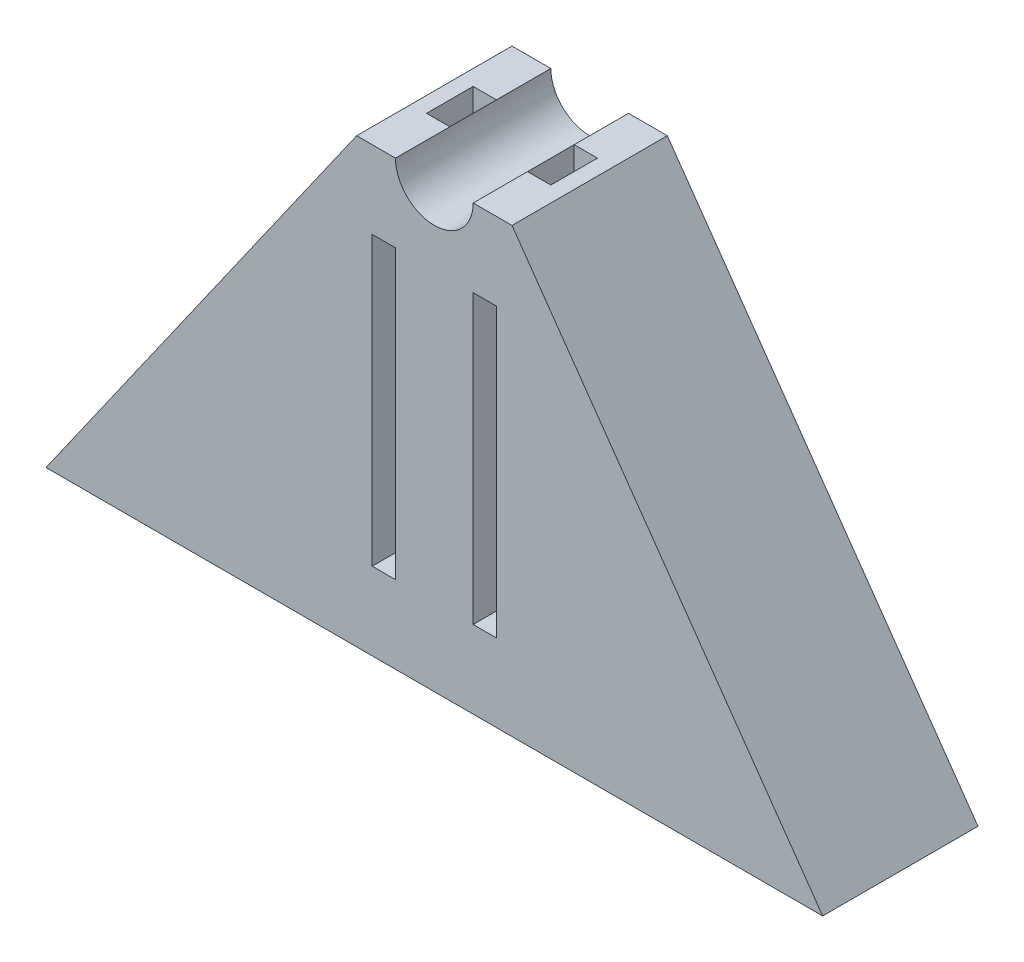
ISO-10303-21;
HEADER;
FILE_DESCRIPTION(('STEP AP214'),'2;1');
FILE_NAME('part.step','',(''),(''),'','','');
FILE_SCHEMA(('AUTOMOTIVE_DESIGN { 1 0 10303 214 1 1 1 1 }'));
ENDSEC;
DATA;
#1=APPLICATION_CONTEXT('core data for automotive mechanical design processes');
#2=APPLICATION_PROTOCOL_DEFINITION('international standard','automotive_design',2000,#1);
#3=PRODUCT_CONTEXT('',#1,'mechanical');
#4=PRODUCT('Part','Part','',(#3));
#5=PRODUCT_RELATED_PRODUCT_CATEGORY('part','',(#4));
#6=PRODUCT_DEFINITION_FORMATION('','',#4);
#7=PRODUCT_DEFINITION_CONTEXT('part definition',#1,'design');
#8=PRODUCT_DEFINITION('design','',#6,#7);
#9=PRODUCT_DEFINITION_SHAPE('','',#8);
#10=(LENGTH_UNIT() NAMED_UNIT(*) SI_UNIT(.MILLI.,.METRE.));
#11=(NAMED_UNIT(*) PLANE_ANGLE_UNIT() SI_UNIT($,.RADIAN.));
#12=(NAMED_UNIT(*) SI_UNIT($,.STERADIAN.) SOLID_ANGLE_UNIT());
#13=UNCERTAINTY_MEASURE_WITH_UNIT(LENGTH_MEASURE(1.E-05),#10,'distance_accuracy_value','');
#14=(GEOMETRIC_REPRESENTATION_CONTEXT(3) GLOBAL_UNCERTAINTY_ASSIGNED_CONTEXT((#13)) GLOBAL_UNIT_ASSIGNED_CONTEXT((#10,
#11,#12)) REPRESENTATION_CONTEXT('',''));
#15=CARTESIAN_POINT('',(0.,0.,0.));
#16=DIRECTION('',(0.,0.,1.));
#17=DIRECTION('',(1.,0.,0.));
#18=AXIS2_PLACEMENT_3D('',#15,#16,#17);
#19=CARTESIAN_POINT('',(-4.,0.,6.5));
#20=DIRECTION('',(0.,0.,1.));
#21=DIRECTION('',(1.,0.,0.));
#22=AXIS2_PLACEMENT_3D('',#19,#20,#21);
#23=PLANE('',#22);
#24=DIRECTION('',(1.,0.,0.));
#25=VECTOR('',#24,1.);
#26=CARTESIAN_POINT('',(-4.,-5.,6.5));
#27=LINE('',#26,#25);
#28=CARTESIAN_POINT('',(-4.,-5.,6.5));
#29=VERTEX_POINT('',#28);
#30=CARTESIAN_POINT('',(-2.5,-5.,6.5));
#31=VERTEX_POINT('',#30);
#32=EDGE_CURVE('E354',#29,#31,#27,.T.);
#33=ORIENTED_EDGE('',*,*,#32,.F.);
#34=DIRECTION('',(0.,-1.,0.));
#35=VECTOR('',#34,1.);
#36=CARTESIAN_POINT('',(-4.,0.,6.5));
#37=LINE('',#36,#35);
#38=CARTESIAN_POINT('',(-4.,0.,6.5));
#39=VERTEX_POINT('',#38);
#40=EDGE_CURVE('E437',#39,#29,#37,.T.);
#41=ORIENTED_EDGE('',*,*,#40,.F.);
#42=DIRECTION('',(-1.,0.,0.));
#43=VECTOR('',#42,1.);
#44=CARTESIAN_POINT('',(-4.,0.,6.5));
#45=LINE('',#44,#43);
#46=CARTESIAN_POINT('',(-2.5,0.,6.5));
#47=VERTEX_POINT('',#46);
#48=EDGE_CURVE('E420',#47,#39,#45,.T.);
#49=ORIENTED_EDGE('',*,*,#48,.F.);
#50=DIRECTION('',(0.,-1.,0.));
#51=VECTOR('',#50,1.);
#52=CARTESIAN_POINT('',(-2.5,0.,6.5));
#53=LINE('',#52,#51);
#54=EDGE_CURVE('E443',#47,#31,#53,.T.);
#55=ORIENTED_EDGE('',*,*,#54,.T.);
#56=EDGE_LOOP('',(#33,#41,#49,#55));
#57=FACE_BOUND('',#56,.T.);
#58=ADVANCED_FACE('F38',(#57),#23,.F.);
#59=CARTESIAN_POINT('',(-4.,0.,3.5));
#60=DIRECTION('',(0.,0.,-1.));
#61=DIRECTION('',(-1.,0.,0.));
#62=AXIS2_PLACEMENT_3D('',#59,#60,#61);
#63=PLANE('',#62);
#64=DIRECTION('',(-1.,0.,0.));
#65=VECTOR('',#64,1.);
#66=CARTESIAN_POINT('',(-4.,-5.,3.5));
#67=LINE('',#66,#65);
#68=CARTESIAN_POINT('',(-2.5,-5.,3.5));
#69=VERTEX_POINT('',#68);
#70=CARTESIAN_POINT('',(-4.,-5.,3.5));
#71=VERTEX_POINT('',#70);
#72=EDGE_CURVE('E11',#69,#71,#67,.T.);
#73=ORIENTED_EDGE('',*,*,#72,.F.);
#74=DIRECTION('',(0.,-1.,0.));
#75=VECTOR('',#74,1.);
#76=CARTESIAN_POINT('',(-2.5,0.,3.5));
#77=LINE('',#76,#75);
#78=CARTESIAN_POINT('',(-2.5,0.,3.5));
#79=VERTEX_POINT('',#78);
#80=EDGE_CURVE('E448',#79,#69,#77,.T.);
#81=ORIENTED_EDGE('',*,*,#80,.F.);
#82=DIRECTION('',(1.,0.,0.));
#83=VECTOR('',#82,1.);
#84=CARTESIAN_POINT('',(-4.,0.,3.5));
#85=LINE('',#84,#83);
#86=CARTESIAN_POINT('',(-4.,0.,3.5));
#87=VERTEX_POINT('',#86);
#88=EDGE_CURVE('E411',#87,#79,#85,.T.);
#89=ORIENTED_EDGE('',*,*,#88,.F.);
#90=DIRECTION('',(0.,-1.,0.));
#91=VECTOR('',#90,1.);
#92=CARTESIAN_POINT('',(-4.,0.,3.5));
#93=LINE('',#92,#91);
#94=EDGE_CURVE('E453',#87,#71,#93,.T.);
#95=ORIENTED_EDGE('',*,*,#94,.T.);
#96=EDGE_LOOP('',(#73,#81,#89,#95));
#97=FACE_BOUND('',#96,.T.);
#98=ADVANCED_FACE('F541',(#97),#63,.F.);
#99=CARTESIAN_POINT('',(4.,0.,3.5));
#100=DIRECTION('',(0.,0.,1.));
#101=DIRECTION('',(1.,0.,0.));
#102=AXIS2_PLACEMENT_3D('',#99,#100,#101);
#103=PLANE('',#102);
#104=DIRECTION('',(0.,-1.,0.));
#105=VECTOR('',#104,1.);
#106=CARTESIAN_POINT('',(2.5,0.,3.5));
#107=LINE('',#106,#105);
#108=CARTESIAN_POINT('',(2.5,0.,3.5));
#109=VERTEX_POINT('',#108);
#110=CARTESIAN_POINT('',(2.5,-5.,3.5));
#111=VERTEX_POINT('',#110);
#112=EDGE_CURVE('E393',#109,#111,#107,.T.);
#113=ORIENTED_EDGE('',*,*,#112,.T.);
#114=DIRECTION('',(1.,0.,0.));
#115=VECTOR('',#114,1.);
#116=CARTESIAN_POINT('',(4.,-5.,3.5));
#117=LINE('',#116,#115);
#118=CARTESIAN_POINT('',(4.,-5.,3.5));
#119=VERTEX_POINT('',#118);
#120=EDGE_CURVE('E346',#111,#119,#117,.T.);
#121=ORIENTED_EDGE('',*,*,#120,.T.);
#122=DIRECTION('',(0.,-1.,0.));
#123=VECTOR('',#122,1.);
#124=CARTESIAN_POINT('',(4.,0.,3.5));
#125=LINE('',#124,#123);
#126=CARTESIAN_POINT('',(4.,0.,3.5));
#127=VERTEX_POINT('',#126);
#128=EDGE_CURVE('E387',#127,#119,#125,.T.);
#129=ORIENTED_EDGE('',*,*,#128,.F.);
#130=DIRECTION('',(-1.,0.,0.));
#131=VECTOR('',#130,1.);
#132=CARTESIAN_POINT('',(4.,0.,3.5));
#133=LINE('',#132,#131);
#134=EDGE_CURVE('E368',#127,#109,#133,.T.);
#135=ORIENTED_EDGE('',*,*,#134,.T.);
#136=EDGE_LOOP('',(#113,#121,#129,#135));
#137=FACE_BOUND('',#136,.T.);
#138=ADVANCED_FACE('F629',(#137),#103,.T.);
#139=CARTESIAN_POINT('',(4.,0.,6.5));
#140=DIRECTION('',(0.,0.,-1.));
#141=DIRECTION('',(-1.,0.,0.));
#142=AXIS2_PLACEMENT_3D('',#139,#140,#141);
#143=PLANE('',#142);
#144=DIRECTION('',(0.,-1.,0.));
#145=VECTOR('',#144,1.);
#146=CARTESIAN_POINT('',(4.,0.,6.5));
#147=LINE('',#146,#145);
#148=CARTESIAN_POINT('',(4.,0.,6.5));
#149=VERTEX_POINT('',#148);
#150=CARTESIAN_POINT('',(4.,-5.,6.5));
#151=VERTEX_POINT('',#150);
#152=EDGE_CURVE('E403',#149,#151,#147,.T.);
#153=ORIENTED_EDGE('',*,*,#152,.T.);
#154=DIRECTION('',(-1.,0.,0.));
#155=VECTOR('',#154,1.);
#156=CARTESIAN_POINT('',(4.,-5.,6.5));
#157=LINE('',#156,#155);
#158=CARTESIAN_POINT('',(2.5,-5.,6.5));
#159=VERTEX_POINT('',#158);
#160=EDGE_CURVE('E525',#151,#159,#157,.T.);
#161=ORIENTED_EDGE('',*,*,#160,.T.);
#162=DIRECTION('',(0.,-1.,0.));
#163=VECTOR('',#162,1.);
#164=CARTESIAN_POINT('',(2.5,0.,6.5));
#165=LINE('',#164,#163);
#166=CARTESIAN_POINT('',(2.5,0.,6.5));
#167=VERTEX_POINT('',#166);
#168=EDGE_CURVE('E398',#167,#159,#165,.T.);
#169=ORIENTED_EDGE('',*,*,#168,.F.);
#170=DIRECTION('',(1.,0.,0.));
#171=VECTOR('',#170,1.);
#172=CARTESIAN_POINT('',(4.,0.,6.5));
#173=LINE('',#172,#171);
#174=EDGE_CURVE('E361',#167,#149,#173,.T.);
#175=ORIENTED_EDGE('',*,*,#174,.T.);
#176=EDGE_LOOP('',(#153,#161,#169,#175));
#177=FACE_BOUND('',#176,.T.);
#178=ADVANCED_FACE('F606',(#177),#143,.T.);
#179=CARTESIAN_POINT('',(-25.,-28.5,10.));
#180=DIRECTION('',(0.,1.,0.));
#181=DIRECTION('',(0.,0.,1.));
#182=AXIS2_PLACEMENT_3D('',#179,#180,#181);
#183=PLANE('',#182);
#184=DIRECTION('',(1.,0.,0.));
#185=VECTOR('',#184,1.);
#186=CARTESIAN_POINT('',(-25.,-28.5,0.));
#187=LINE('',#186,#185);
#188=CARTESIAN_POINT('',(-25.,-28.5,0.));
#189=VERTEX_POINT('',#188);
#190=CARTESIAN_POINT('',(25.,-28.5,0.));
#191=VERTEX_POINT('',#190);
#192=EDGE_CURVE('E481',#189,#191,#187,.T.);
#193=ORIENTED_EDGE('',*,*,#192,.T.);
#194=DIRECTION('',(0.,0.,-1.));
#195=VECTOR('',#194,1.);
#196=CARTESIAN_POINT('',(25.,-28.5,10.));
#197=LINE('',#196,#195);
#198=CARTESIAN_POINT('',(25.,-28.5,10.));
#199=VERTEX_POINT('',#198);
#200=EDGE_CURVE('E514',#199,#191,#197,.T.);
#201=ORIENTED_EDGE('',*,*,#200,.F.);
#202=DIRECTION('',(1.,0.,0.));
#203=VECTOR('',#202,1.);
#204=CARTESIAN_POINT('',(-25.,-28.5,10.));
#205=LINE('',#204,#203);
#206=CARTESIAN_POINT('',(-25.,-28.5,10.));
#207=VERTEX_POINT('',#206);
#208=EDGE_CURVE('E461',#207,#199,#205,.T.);
#209=ORIENTED_EDGE('',*,*,#208,.F.);
#210=DIRECTION('',(0.,0.,-1.));
#211=VECTOR('',#210,1.);
#212=CARTESIAN_POINT('',(-25.,-28.5,10.));
#213=LINE('',#212,#211);
#214=EDGE_CURVE('E518',#207,#189,#213,.T.);
#215=ORIENTED_EDGE('',*,*,#214,.T.);
#216=EDGE_LOOP('',(#193,#201,#209,#215));
#217=FACE_BOUND('',#216,.T.);
#218=DIRECTION('',(1.,0.,0.));
#219=VECTOR('',#218,1.);
#220=CARTESIAN_POINT('',(-4.,-28.5,3.5));
#221=LINE('',#220,#219);
#222=CARTESIAN_POINT('',(-4.,-28.5,3.5));
#223=VERTEX_POINT('',#222);
#224=CARTESIAN_POINT('',(-2.5,-28.5,3.5));
#225=VERTEX_POINT('',#224);
#226=EDGE_CURVE('E426',#223,#225,#221,.T.);
#227=ORIENTED_EDGE('',*,*,#226,.F.);
#228=DIRECTION('',(0.,0.,-1.));
#229=VECTOR('',#228,1.);
#230=CARTESIAN_POINT('',(-4.,-28.5,6.5));
#231=LINE('',#230,#229);
#232=CARTESIAN_POINT('',(-4.,-28.5,6.5));
#233=VERTEX_POINT('',#232);
#234=EDGE_CURVE('E391',#233,#223,#231,.T.);
#235=ORIENTED_EDGE('',*,*,#234,.F.);
#236=DIRECTION('',(-1.,0.,0.));
#237=VECTOR('',#236,1.);
#238=CARTESIAN_POINT('',(-4.,-28.5,6.5));
#239=LINE('',#238,#237);
#240=CARTESIAN_POINT('',(-2.5,-28.5,6.5));
#241=VERTEX_POINT('',#240);
#242=EDGE_CURVE('E412',#241,#233,#239,.T.);
#243=ORIENTED_EDGE('',*,*,#242,.F.);
#244=DIRECTION('',(0.,0.,1.));
#245=VECTOR('',#244,1.);
#246=CARTESIAN_POINT('',(-2.5,-28.5,6.5));
#247=LINE('',#246,#245);
#248=EDGE_CURVE('E430',#225,#241,#247,.T.);
#249=ORIENTED_EDGE('',*,*,#248,.F.);
#250=EDGE_LOOP('',(#227,#235,#243,#249));
#251=FACE_BOUND('',#250,.T.);
#252=DIRECTION('',(0.,0.,-1.));
#253=VECTOR('',#252,1.);
#254=CARTESIAN_POINT('',(4.,-28.5,6.5));
#255=LINE('',#254,#253);
#256=CARTESIAN_POINT('',(4.,-28.5,6.5));
#257=VERTEX_POINT('',#256);
#258=CARTESIAN_POINT('',(4.,-28.5,3.5));
#259=VERTEX_POINT('',#258);
#260=EDGE_CURVE('E357',#257,#259,#255,.T.);
#261=ORIENTED_EDGE('',*,*,#260,.T.);
#262=DIRECTION('',(-1.,0.,0.));
#263=VECTOR('',#262,1.);
#264=CARTESIAN_POINT('',(4.,-28.5,3.5));
#265=LINE('',#264,#263);
#266=CARTESIAN_POINT('',(2.5,-28.5,3.5));
#267=VERTEX_POINT('',#266);
#268=EDGE_CURVE('E362',#259,#267,#265,.T.);
#269=ORIENTED_EDGE('',*,*,#268,.T.);
#270=DIRECTION('',(0.,0.,1.));
#271=VECTOR('',#270,1.);
#272=CARTESIAN_POINT('',(2.5,-28.5,6.5));
#273=LINE('',#272,#271);
#274=CARTESIAN_POINT('',(2.5,-28.5,6.5));
#275=VERTEX_POINT('',#274);
#276=EDGE_CURVE('E380',#267,#275,#273,.T.);
#277=ORIENTED_EDGE('',*,*,#276,.T.);
#278=DIRECTION('',(1.,0.,0.));
#279=VECTOR('',#278,1.);
#280=CARTESIAN_POINT('',(4.,-28.5,6.5));
#281=LINE('',#280,#279);
#282=EDGE_CURVE('E376',#275,#257,#281,.T.);
#283=ORIENTED_EDGE('',*,*,#282,.T.);
#284=EDGE_LOOP('',(#261,#269,#277,#283));
#285=FACE_BOUND('',#284,.T.);
#286=ADVANCED_FACE('F645',(#217,#251,#285),#183,.F.);
#287=CARTESIAN_POINT('',(5.,0.,10.));
#288=DIRECTION('',(0.,-1.,0.));
#289=DIRECTION('',(1.,0.,0.));
#290=AXIS2_PLACEMENT_3D('',#287,#288,#289);
#291=PLANE('',#290);
#292=ORIENTED_EDGE('',*,*,#134,.F.);
#293=DIRECTION('',(0.,0.,-1.));
#294=VECTOR('',#293,1.);
#295=CARTESIAN_POINT('',(4.,0.,6.5));
#296=LINE('',#295,#294);
#297=EDGE_CURVE('E358',#149,#127,#296,.T.);
#298=ORIENTED_EDGE('',*,*,#297,.F.);
#299=ORIENTED_EDGE('',*,*,#174,.F.);
#300=DIRECTION('',(0.,0.,-1.));
#301=VECTOR('',#300,1.);
#302=CARTESIAN_POINT('',(2.5,0.,10.));
#303=LINE('',#302,#301);
#304=CARTESIAN_POINT('',(2.5,0.,10.));
#305=VERTEX_POINT('',#304);
#306=EDGE_CURVE('E506',#305,#167,#303,.T.);
#307=ORIENTED_EDGE('',*,*,#306,.F.);
#308=DIRECTION('',(-1.,0.,0.));
#309=VECTOR('',#308,1.);
#310=CARTESIAN_POINT('',(5.,0.,10.));
#311=LINE('',#310,#309);
#312=CARTESIAN_POINT('',(5.,0.,10.));
#313=VERTEX_POINT('',#312);
#314=EDGE_CURVE('E468',#313,#305,#311,.T.);
#315=ORIENTED_EDGE('',*,*,#314,.F.);
#316=DIRECTION('',(0.,0.,-1.));
#317=VECTOR('',#316,1.);
#318=CARTESIAN_POINT('',(5.,0.,10.));
#319=LINE('',#318,#317);
#320=CARTESIAN_POINT('',(5.,0.,0.));
#321=VERTEX_POINT('',#320);
#322=EDGE_CURVE('E510',#313,#321,#319,.T.);
#323=ORIENTED_EDGE('',*,*,#322,.T.);
#324=DIRECTION('',(-1.,0.,0.));
#325=VECTOR('',#324,1.);
#326=CARTESIAN_POINT('',(5.,0.,0.));
#327=LINE('',#326,#325);
#328=CARTESIAN_POINT('',(2.5,0.,0.));
#329=VERTEX_POINT('',#328);
#330=EDGE_CURVE('E487',#321,#329,#327,.T.);
#331=ORIENTED_EDGE('',*,*,#330,.T.);
#332=EDGE_CURVE('E505',#109,#329,#303,.T.);
#333=ORIENTED_EDGE('',*,*,#332,.F.);
#334=EDGE_LOOP('',(#292,#298,#299,#307,#315,#323,#331,#333));
#335=FACE_BOUND('',#334,.T.);
#336=ADVANCED_FACE('F588',(#335),#291,.F.);
#337=CARTESIAN_POINT('',(-5.,0.,10.));
#338=DIRECTION('',(0.818556692462413,-0.57442574909643,0.));
#339=DIRECTION('',(0.57442574909643,0.818556692462413,0.));
#340=AXIS2_PLACEMENT_3D('',#337,#338,#339);
#341=PLANE('',#340);
#342=DIRECTION('',(-0.57442574909643,-0.818556692462413,0.));
#343=VECTOR('',#342,1.);
#344=CARTESIAN_POINT('',(-5.,0.,0.));
#345=LINE('',#344,#343);
#346=CARTESIAN_POINT('',(-5.,0.,0.));
#347=VERTEX_POINT('',#346);
#348=EDGE_CURVE('E441',#347,#189,#345,.T.);
#349=ORIENTED_EDGE('',*,*,#348,.T.);
#350=ORIENTED_EDGE('',*,*,#214,.F.);
#351=DIRECTION('',(-0.57442574909643,-0.818556692462413,0.));
#352=VECTOR('',#351,1.);
#353=CARTESIAN_POINT('',(-5.,0.,10.));
#354=LINE('',#353,#352);
#355=CARTESIAN_POINT('',(-5.,0.,10.));
#356=VERTEX_POINT('',#355);
#357=EDGE_CURVE('E457',#356,#207,#354,.T.);
#358=ORIENTED_EDGE('',*,*,#357,.F.);
#359=DIRECTION('',(0.,0.,-1.));
#360=VECTOR('',#359,1.);
#361=CARTESIAN_POINT('',(-5.,0.,10.));
#362=LINE('',#361,#360);
#363=EDGE_CURVE('E477',#356,#347,#362,.T.);
#364=ORIENTED_EDGE('',*,*,#363,.T.);
#365=EDGE_LOOP('',(#349,#350,#358,#364));
#366=FACE_BOUND('',#365,.T.);
#367=ADVANCED_FACE('F40',(#366),#341,.F.);
#368=CARTESIAN_POINT('',(25.,-28.5,10.));
#369=DIRECTION('',(-0.818556692462413,-0.57442574909643,0.));
#370=DIRECTION('',(0.57442574909643,-0.818556692462413,0.));
#371=AXIS2_PLACEMENT_3D('',#368,#369,#370);
#372=PLANE('',#371);
#373=DIRECTION('',(-0.57442574909643,0.818556692462413,0.));
#374=VECTOR('',#373,1.);
#375=CARTESIAN_POINT('',(25.,-28.5,0.));
#376=LINE('',#375,#374);
#377=EDGE_CURVE('E484',#191,#321,#376,.T.);
#378=ORIENTED_EDGE('',*,*,#377,.T.);
#379=ORIENTED_EDGE('',*,*,#322,.F.);
#380=DIRECTION('',(-0.57442574909643,0.818556692462413,0.));
#381=VECTOR('',#380,1.);
#382=CARTESIAN_POINT('',(25.,-28.5,10.));
#383=LINE('',#382,#381);
#384=EDGE_CURVE('E465',#199,#313,#383,.T.);
#385=ORIENTED_EDGE('',*,*,#384,.F.);
#386=ORIENTED_EDGE('',*,*,#200,.T.);
#387=EDGE_LOOP('',(#378,#379,#385,#386));
#388=FACE_BOUND('',#387,.T.);
#389=ADVANCED_FACE('F691',(#388),#372,.F.);
#390=CARTESIAN_POINT('',(0.,0.,10.));
#391=DIRECTION('',(0.,0.,-1.));
#392=DIRECTION('',(-1.,0.,0.));
#393=AXIS2_PLACEMENT_3D('',#390,#391,#392);
#394=CYLINDRICAL_SURFACE('',#393,2.5);
#395=CARTESIAN_POINT('',(0.,0.,0.));
#396=DIRECTION('',(0.,0.,-1.));
#397=DIRECTION('',(1.,0.,0.));
#398=AXIS2_PLACEMENT_3D('',#395,#396,#397);
#399=CIRCLE('',#398,2.5);
#400=CARTESIAN_POINT('',(-2.5,0.,0.));
#401=VERTEX_POINT('',#400);
#402=EDGE_CURVE('E491',#329,#401,#399,.T.);
#403=ORIENTED_EDGE('',*,*,#402,.T.);
#404=DIRECTION('',(0.,0.,-1.));
#405=VECTOR('',#404,1.);
#406=CARTESIAN_POINT('',(-2.5,0.,10.));
#407=LINE('',#406,#405);
#408=EDGE_CURVE('E500',#79,#401,#407,.T.);
#409=ORIENTED_EDGE('',*,*,#408,.F.);
#410=DIRECTION('',(0.,0.,1.));
#411=VECTOR('',#410,1.);
#412=CARTESIAN_POINT('',(-2.5,0.,6.5));
#413=LINE('',#412,#411);
#414=EDGE_CURVE('E416',#79,#47,#413,.T.);
#415=ORIENTED_EDGE('',*,*,#414,.T.);
#416=CARTESIAN_POINT('',(-2.5,0.,10.));
#417=VERTEX_POINT('',#416);
#418=EDGE_CURVE('E501',#417,#47,#407,.T.);
#419=ORIENTED_EDGE('',*,*,#418,.F.);
#420=CARTESIAN_POINT('',(0.,0.,10.));
#421=DIRECTION('',(0.,0.,-1.));
#422=DIRECTION('',(1.,0.,0.));
#423=AXIS2_PLACEMENT_3D('',#420,#421,#422);
#424=CIRCLE('',#423,2.5);
#425=EDGE_CURVE('E471',#305,#417,#424,.T.);
#426=ORIENTED_EDGE('',*,*,#425,.F.);
#427=ORIENTED_EDGE('',*,*,#306,.T.);
#428=DIRECTION('',(0.,0.,1.));
#429=VECTOR('',#428,1.);
#430=CARTESIAN_POINT('',(2.5,0.,6.5));
#431=LINE('',#430,#429);
#432=EDGE_CURVE('E365',#109,#167,#431,.T.);
#433=ORIENTED_EDGE('',*,*,#432,.F.);
#434=ORIENTED_EDGE('',*,*,#332,.T.);
#435=EDGE_LOOP('',(#403,#409,#415,#419,#426,#427,#433,#434));
#436=FACE_BOUND('',#435,.T.);
#437=ADVANCED_FACE('F553',(#436),#394,.F.);
#438=CARTESIAN_POINT('',(-2.5,0.,10.));
#439=DIRECTION('',(0.,-1.,0.));
#440=DIRECTION('',(1.,0.,0.));
#441=AXIS2_PLACEMENT_3D('',#438,#439,#440);
#442=PLANE('',#441);
#443=ORIENTED_EDGE('',*,*,#418,.T.);
#444=ORIENTED_EDGE('',*,*,#48,.T.);
#445=DIRECTION('',(0.,0.,-1.));
#446=VECTOR('',#445,1.);
#447=CARTESIAN_POINT('',(-4.,0.,6.5));
#448=LINE('',#447,#446);
#449=EDGE_CURVE('E407',#39,#87,#448,.T.);
#450=ORIENTED_EDGE('',*,*,#449,.T.);
#451=ORIENTED_EDGE('',*,*,#88,.T.);
#452=ORIENTED_EDGE('',*,*,#408,.T.);
#453=DIRECTION('',(-1.,0.,0.));
#454=VECTOR('',#453,1.);
#455=CARTESIAN_POINT('',(-2.5,0.,0.));
#456=LINE('',#455,#454);
#457=EDGE_CURVE('E462',#401,#347,#456,.T.);
#458=ORIENTED_EDGE('',*,*,#457,.T.);
#459=ORIENTED_EDGE('',*,*,#363,.F.);
#460=DIRECTION('',(-1.,0.,0.));
#461=VECTOR('',#460,1.);
#462=CARTESIAN_POINT('',(-2.5,0.,10.));
#463=LINE('',#462,#461);
#464=EDGE_CURVE('E474',#417,#356,#463,.T.);
#465=ORIENTED_EDGE('',*,*,#464,.F.);
#466=EDGE_LOOP('',(#443,#444,#450,#451,#452,#458,#459,#465));
#467=FACE_BOUND('',#466,.T.);
#468=ADVANCED_FACE('F546',(#467),#442,.F.);
#469=CARTESIAN_POINT('',(0.,0.,10.));
#470=DIRECTION('',(0.,0.,1.));
#471=DIRECTION('',(1.,0.,0.));
#472=AXIS2_PLACEMENT_3D('',#469,#470,#471);
#473=PLANE('',#472);
#474=DIRECTION('',(0.,-1.,0.));
#475=VECTOR('',#474,1.);
#476=CARTESIAN_POINT('',(-4.,0.,10.));
#477=LINE('',#476,#475);
#478=CARTESIAN_POINT('',(-4.,-5.,10.));
#479=VERTEX_POINT('',#478);
#480=CARTESIAN_POINT('',(-4.,-23.5,10.));
#481=VERTEX_POINT('',#480);
#482=EDGE_CURVE('E54',#479,#481,#477,.T.);
#483=ORIENTED_EDGE('',*,*,#482,.F.);
#484=DIRECTION('',(1.,0.,0.));
#485=VECTOR('',#484,1.);
#486=CARTESIAN_POINT('',(0.,-5.,10.));
#487=LINE('',#486,#485);
#488=CARTESIAN_POINT('',(-2.5,-5.,10.));
#489=VERTEX_POINT('',#488);
#490=EDGE_CURVE('E266',#479,#489,#487,.T.);
#491=ORIENTED_EDGE('',*,*,#490,.T.);
#492=DIRECTION('',(0.,1.,0.));
#493=VECTOR('',#492,1.);
#494=CARTESIAN_POINT('',(-2.5,0.,10.));
#495=LINE('',#494,#493);
#496=CARTESIAN_POINT('',(-2.5,-23.5,10.));
#497=VERTEX_POINT('',#496);
#498=EDGE_CURVE('E270',#497,#489,#495,.T.);
#499=ORIENTED_EDGE('',*,*,#498,.F.);
#500=DIRECTION('',(1.,0.,0.));
#501=VECTOR('',#500,1.);
#502=CARTESIAN_POINT('',(0.,-23.5,10.));
#503=LINE('',#502,#501);
#504=EDGE_CURVE('E279',#481,#497,#503,.T.);
#505=ORIENTED_EDGE('',*,*,#504,.F.);
#506=EDGE_LOOP('',(#483,#491,#499,#505));
#507=FACE_BOUND('',#506,.T.);
#508=DIRECTION('',(0.,-1.,0.));
#509=VECTOR('',#508,1.);
#510=CARTESIAN_POINT('',(2.5,0.,10.));
#511=LINE('',#510,#509);
#512=CARTESIAN_POINT('',(2.5,-5.,10.));
#513=VERTEX_POINT('',#512);
#514=CARTESIAN_POINT('',(2.5,-23.5,10.));
#515=VERTEX_POINT('',#514);
#516=EDGE_CURVE('E62',#513,#515,#511,.T.);
#517=ORIENTED_EDGE('',*,*,#516,.F.);
#518=DIRECTION('',(1.,0.,0.));
#519=VECTOR('',#518,1.);
#520=CARTESIAN_POINT('',(0.,-5.,10.));
#521=LINE('',#520,#519);
#522=CARTESIAN_POINT('',(4.,-5.,10.));
#523=VERTEX_POINT('',#522);
#524=EDGE_CURVE('E303',#513,#523,#521,.T.);
#525=ORIENTED_EDGE('',*,*,#524,.T.);
#526=DIRECTION('',(0.,1.,0.));
#527=VECTOR('',#526,1.);
#528=CARTESIAN_POINT('',(4.,0.,10.));
#529=LINE('',#528,#527);
#530=CARTESIAN_POINT('',(4.,-23.5,10.));
#531=VERTEX_POINT('',#530);
#532=EDGE_CURVE('E321',#531,#523,#529,.T.);
#533=ORIENTED_EDGE('',*,*,#532,.F.);
#534=DIRECTION('',(1.,0.,0.));
#535=VECTOR('',#534,1.);
#536=CARTESIAN_POINT('',(0.,-23.5,10.));
#537=LINE('',#536,#535);
#538=EDGE_CURVE('E317',#515,#531,#537,.T.);
#539=ORIENTED_EDGE('',*,*,#538,.F.);
#540=EDGE_LOOP('',(#517,#525,#533,#539));
#541=FACE_BOUND('',#540,.T.);
#542=ORIENTED_EDGE('',*,*,#357,.T.);
#543=ORIENTED_EDGE('',*,*,#208,.T.);
#544=ORIENTED_EDGE('',*,*,#384,.T.);
#545=ORIENTED_EDGE('',*,*,#314,.T.);
#546=ORIENTED_EDGE('',*,*,#425,.T.);
#547=ORIENTED_EDGE('',*,*,#464,.T.);
#548=EDGE_LOOP('',(#542,#543,#544,#545,#546,#547));
#549=FACE_BOUND('',#548,.T.);
#550=ADVANCED_FACE('F568',(#507,#541,#549),#473,.T.);
#551=CARTESIAN_POINT('',(0.,0.,0.));
#552=DIRECTION('',(0.,0.,1.));
#553=DIRECTION('',(1.,0.,0.));
#554=AXIS2_PLACEMENT_3D('',#551,#552,#553);
#555=PLANE('',#554);
#556=DIRECTION('',(1.,0.,0.));
#557=VECTOR('',#556,1.);
#558=CARTESIAN_POINT('',(0.,-5.,0.));
#559=LINE('',#558,#557);
#560=CARTESIAN_POINT('',(-4.,-5.,0.));
#561=VERTEX_POINT('',#560);
#562=CARTESIAN_POINT('',(-2.5,-5.,0.));
#563=VERTEX_POINT('',#562);
#564=EDGE_CURVE('E264',#561,#563,#559,.T.);
#565=ORIENTED_EDGE('',*,*,#564,.F.);
#566=DIRECTION('',(0.,-1.,0.));
#567=VECTOR('',#566,1.);
#568=CARTESIAN_POINT('',(-4.,0.,0.));
#569=LINE('',#568,#567);
#570=CARTESIAN_POINT('',(-4.,-23.5,0.));
#571=VERTEX_POINT('',#570);
#572=EDGE_CURVE('E241',#561,#571,#569,.T.);
#573=ORIENTED_EDGE('',*,*,#572,.T.);
#574=DIRECTION('',(1.,0.,0.));
#575=VECTOR('',#574,1.);
#576=CARTESIAN_POINT('',(0.,-23.5,0.));
#577=LINE('',#576,#575);
#578=CARTESIAN_POINT('',(-2.5,-23.5,0.));
#579=VERTEX_POINT('',#578);
#580=EDGE_CURVE('E253',#571,#579,#577,.T.);
#581=ORIENTED_EDGE('',*,*,#580,.T.);
#582=DIRECTION('',(0.,1.,0.));
#583=VECTOR('',#582,1.);
#584=CARTESIAN_POINT('',(-2.5,0.,0.));
#585=LINE('',#584,#583);
#586=EDGE_CURVE('E260',#579,#563,#585,.T.);
#587=ORIENTED_EDGE('',*,*,#586,.T.);
#588=EDGE_LOOP('',(#565,#573,#581,#587));
#589=FACE_BOUND('',#588,.T.);
#590=DIRECTION('',(1.,0.,0.));
#591=VECTOR('',#590,1.);
#592=CARTESIAN_POINT('',(0.,-5.,0.));
#593=LINE('',#592,#591);
#594=CARTESIAN_POINT('',(2.5,-5.,0.));
#595=VERTEX_POINT('',#594);
#596=CARTESIAN_POINT('',(4.,-5.,0.));
#597=VERTEX_POINT('',#596);
#598=EDGE_CURVE('E311',#595,#597,#593,.T.);
#599=ORIENTED_EDGE('',*,*,#598,.F.);
#600=DIRECTION('',(0.,-1.,0.));
#601=VECTOR('',#600,1.);
#602=CARTESIAN_POINT('',(2.5,0.,0.));
#603=LINE('',#602,#601);
#604=CARTESIAN_POINT('',(2.5,-23.5,0.));
#605=VERTEX_POINT('',#604);
#606=EDGE_CURVE('E298',#595,#605,#603,.T.);
#607=ORIENTED_EDGE('',*,*,#606,.T.);
#608=DIRECTION('',(1.,0.,0.));
#609=VECTOR('',#608,1.);
#610=CARTESIAN_POINT('',(0.,-23.5,0.));
#611=LINE('',#610,#609);
#612=CARTESIAN_POINT('',(4.,-23.5,0.));
#613=VERTEX_POINT('',#612);
#614=EDGE_CURVE('E302',#605,#613,#611,.T.);
#615=ORIENTED_EDGE('',*,*,#614,.T.);
#616=DIRECTION('',(0.,1.,0.));
#617=VECTOR('',#616,1.);
#618=CARTESIAN_POINT('',(4.,0.,0.));
#619=LINE('',#618,#617);
#620=EDGE_CURVE('E307',#613,#597,#619,.T.);
#621=ORIENTED_EDGE('',*,*,#620,.T.);
#622=EDGE_LOOP('',(#599,#607,#615,#621));
#623=FACE_BOUND('',#622,.T.);
#624=ORIENTED_EDGE('',*,*,#348,.F.);
#625=ORIENTED_EDGE('',*,*,#457,.F.);
#626=ORIENTED_EDGE('',*,*,#402,.F.);
#627=ORIENTED_EDGE('',*,*,#330,.F.);
#628=ORIENTED_EDGE('',*,*,#377,.F.);
#629=ORIENTED_EDGE('',*,*,#192,.F.);
#630=EDGE_LOOP('',(#624,#625,#626,#627,#628,#629));
#631=FACE_BOUND('',#630,.T.);
#632=ADVANCED_FACE('F262',(#589,#623,#631),#555,.F.);
#633=CARTESIAN_POINT('',(-4.,0.,6.5));
#634=DIRECTION('',(-1.,0.,0.));
#635=DIRECTION('',(0.,0.,1.));
#636=AXIS2_PLACEMENT_3D('',#633,#634,#635);
#637=PLANE('',#636);
#638=CARTESIAN_POINT('',(-4.,-23.5,3.5));
#639=VERTEX_POINT('',#638);
#640=EDGE_CURVE('E244',#639,#223,#93,.T.);
#641=ORIENTED_EDGE('',*,*,#640,.F.);
#642=DIRECTION('',(0.,0.,1.));
#643=VECTOR('',#642,1.);
#644=CARTESIAN_POINT('',(-4.,-23.5,0.));
#645=LINE('',#644,#643);
#646=EDGE_CURVE('E236',#571,#639,#645,.T.);
#647=ORIENTED_EDGE('',*,*,#646,.F.);
#648=ORIENTED_EDGE('',*,*,#572,.F.);
#649=DIRECTION('',(0.,0.,1.));
#650=VECTOR('',#649,1.);
#651=CARTESIAN_POINT('',(-4.,-5.,0.));
#652=LINE('',#651,#650);
#653=EDGE_CURVE('E287',#561,#71,#652,.T.);
#654=ORIENTED_EDGE('',*,*,#653,.T.);
#655=ORIENTED_EDGE('',*,*,#94,.F.);
#656=ORIENTED_EDGE('',*,*,#449,.F.);
#657=ORIENTED_EDGE('',*,*,#40,.T.);
#658=EDGE_CURVE('E291',#29,#479,#652,.T.);
#659=ORIENTED_EDGE('',*,*,#658,.T.);
#660=ORIENTED_EDGE('',*,*,#482,.T.);
#661=CARTESIAN_POINT('',(-4.,-23.5,6.5));
#662=VERTEX_POINT('',#661);
#663=EDGE_CURVE('E249',#662,#481,#645,.T.);
#664=ORIENTED_EDGE('',*,*,#663,.F.);
#665=EDGE_CURVE('E442',#662,#233,#37,.T.);
#666=ORIENTED_EDGE('',*,*,#665,.T.);
#667=ORIENTED_EDGE('',*,*,#234,.T.);
#668=EDGE_LOOP('',(#641,#647,#648,#654,#655,#656,#657,#659,#660,#664,#666,#667));
#669=FACE_BOUND('',#668,.T.);
#670=ADVANCED_FACE('F238',(#669),#637,.F.);
#671=ORIENTED_EDGE('',*,*,#665,.F.);
#672=DIRECTION('',(1.,0.,0.));
#673=VECTOR('',#672,1.);
#674=CARTESIAN_POINT('',(-4.,-23.5,6.5));
#675=LINE('',#674,#673);
#676=CARTESIAN_POINT('',(-2.5,-23.5,6.5));
#677=VERTEX_POINT('',#676);
#678=EDGE_CURVE('E350',#662,#677,#675,.T.);
#679=ORIENTED_EDGE('',*,*,#678,.T.);
#680=EDGE_CURVE('E447',#677,#241,#53,.T.);
#681=ORIENTED_EDGE('',*,*,#680,.T.);
#682=ORIENTED_EDGE('',*,*,#242,.T.);
#683=EDGE_LOOP('',(#671,#679,#681,#682));
#684=FACE_BOUND('',#683,.T.);
#685=ADVANCED_FACE('F663',(#684),#23,.F.);
#686=CARTESIAN_POINT('',(-2.5,0.,6.5));
#687=DIRECTION('',(1.,0.,0.));
#688=DIRECTION('',(0.,0.,-1.));
#689=AXIS2_PLACEMENT_3D('',#686,#687,#688);
#690=PLANE('',#689);
#691=ORIENTED_EDGE('',*,*,#680,.F.);
#692=DIRECTION('',(0.,0.,1.));
#693=VECTOR('',#692,1.);
#694=CARTESIAN_POINT('',(-2.5,-23.5,0.));
#695=LINE('',#694,#693);
#696=EDGE_CURVE('E248',#677,#497,#695,.T.);
#697=ORIENTED_EDGE('',*,*,#696,.T.);
#698=ORIENTED_EDGE('',*,*,#498,.T.);
#699=DIRECTION('',(0.,0.,1.));
#700=VECTOR('',#699,1.);
#701=CARTESIAN_POINT('',(-2.5,-5.,0.));
#702=LINE('',#701,#700);
#703=EDGE_CURVE('E295',#31,#489,#702,.T.);
#704=ORIENTED_EDGE('',*,*,#703,.F.);
#705=ORIENTED_EDGE('',*,*,#54,.F.);
#706=ORIENTED_EDGE('',*,*,#414,.F.);
#707=ORIENTED_EDGE('',*,*,#80,.T.);
#708=EDGE_CURVE('E292',#563,#69,#702,.T.);
#709=ORIENTED_EDGE('',*,*,#708,.F.);
#710=ORIENTED_EDGE('',*,*,#586,.F.);
#711=CARTESIAN_POINT('',(-2.5,-23.5,3.5));
#712=VERTEX_POINT('',#711);
#713=EDGE_CURVE('E256',#579,#712,#695,.T.);
#714=ORIENTED_EDGE('',*,*,#713,.T.);
#715=EDGE_CURVE('E452',#712,#225,#77,.T.);
#716=ORIENTED_EDGE('',*,*,#715,.T.);
#717=ORIENTED_EDGE('',*,*,#248,.T.);
#718=EDGE_LOOP('',(#691,#697,#698,#704,#705,#706,#707,#709,#710,#714,#716,#717));
#719=FACE_BOUND('',#718,.T.);
#720=ADVANCED_FACE('F534',(#719),#690,.F.);
#721=ORIENTED_EDGE('',*,*,#715,.F.);
#722=DIRECTION('',(-1.,0.,0.));
#723=VECTOR('',#722,1.);
#724=CARTESIAN_POINT('',(-4.,-23.5,3.5));
#725=LINE('',#724,#723);
#726=EDGE_CURVE('E47',#712,#639,#725,.T.);
#727=ORIENTED_EDGE('',*,*,#726,.T.);
#728=ORIENTED_EDGE('',*,*,#640,.T.);
#729=ORIENTED_EDGE('',*,*,#226,.T.);
#730=EDGE_LOOP('',(#721,#727,#728,#729));
#731=FACE_BOUND('',#730,.T.);
#732=ADVANCED_FACE('F531',(#731),#63,.F.);
#733=CARTESIAN_POINT('',(4.,0.,6.5));
#734=DIRECTION('',(-1.,0.,0.));
#735=DIRECTION('',(0.,0.,1.));
#736=AXIS2_PLACEMENT_3D('',#733,#734,#735);
#737=PLANE('',#736);
#738=CARTESIAN_POINT('',(4.,-23.5,6.5));
#739=VERTEX_POINT('',#738);
#740=EDGE_CURVE('E372',#739,#257,#147,.T.);
#741=ORIENTED_EDGE('',*,*,#740,.F.);
#742=DIRECTION('',(0.,0.,1.));
#743=VECTOR('',#742,1.);
#744=CARTESIAN_POINT('',(4.,-23.5,0.));
#745=LINE('',#744,#743);
#746=EDGE_CURVE('E340',#739,#531,#745,.T.);
#747=ORIENTED_EDGE('',*,*,#746,.T.);
#748=ORIENTED_EDGE('',*,*,#532,.T.);
#749=DIRECTION('',(0.,0.,1.));
#750=VECTOR('',#749,1.);
#751=CARTESIAN_POINT('',(4.,-5.,0.));
#752=LINE('',#751,#750);
#753=EDGE_CURVE('E335',#151,#523,#752,.T.);
#754=ORIENTED_EDGE('',*,*,#753,.F.);
#755=ORIENTED_EDGE('',*,*,#152,.F.);
#756=ORIENTED_EDGE('',*,*,#297,.T.);
#757=ORIENTED_EDGE('',*,*,#128,.T.);
#758=EDGE_CURVE('E332',#597,#119,#752,.T.);
#759=ORIENTED_EDGE('',*,*,#758,.F.);
#760=ORIENTED_EDGE('',*,*,#620,.F.);
#761=CARTESIAN_POINT('',(4.,-23.5,3.5));
#762=VERTEX_POINT('',#761);
#763=EDGE_CURVE('E336',#613,#762,#745,.T.);
#764=ORIENTED_EDGE('',*,*,#763,.T.);
#765=EDGE_CURVE('E392',#762,#259,#125,.T.);
#766=ORIENTED_EDGE('',*,*,#765,.T.);
#767=ORIENTED_EDGE('',*,*,#260,.F.);
#768=EDGE_LOOP('',(#741,#747,#748,#754,#755,#756,#757,#759,#760,#764,#766,#767));
#769=FACE_BOUND('',#768,.T.);
#770=ADVANCED_FACE('F610',(#769),#737,.T.);
#771=DIRECTION('',(1.,0.,0.));
#772=VECTOR('',#771,1.);
#773=CARTESIAN_POINT('',(4.,-23.5,3.5));
#774=LINE('',#773,#772);
#775=CARTESIAN_POINT('',(2.5,-23.5,3.5));
#776=VERTEX_POINT('',#775);
#777=EDGE_CURVE('E290',#776,#762,#774,.T.);
#778=ORIENTED_EDGE('',*,*,#777,.F.);
#779=EDGE_CURVE('E397',#776,#267,#107,.T.);
#780=ORIENTED_EDGE('',*,*,#779,.T.);
#781=ORIENTED_EDGE('',*,*,#268,.F.);
#782=ORIENTED_EDGE('',*,*,#765,.F.);
#783=EDGE_LOOP('',(#778,#780,#781,#782));
#784=FACE_BOUND('',#783,.T.);
#785=ADVANCED_FACE('F642',(#784),#103,.T.);
#786=CARTESIAN_POINT('',(2.5,0.,6.5));
#787=DIRECTION('',(1.,0.,0.));
#788=DIRECTION('',(0.,0.,-1.));
#789=AXIS2_PLACEMENT_3D('',#786,#787,#788);
#790=PLANE('',#789);
#791=ORIENTED_EDGE('',*,*,#779,.F.);
#792=DIRECTION('',(0.,0.,1.));
#793=VECTOR('',#792,1.);
#794=CARTESIAN_POINT('',(2.5,-23.5,0.));
#795=LINE('',#794,#793);
#796=EDGE_CURVE('E341',#605,#776,#795,.T.);
#797=ORIENTED_EDGE('',*,*,#796,.F.);
#798=ORIENTED_EDGE('',*,*,#606,.F.);
#799=DIRECTION('',(0.,0.,1.));
#800=VECTOR('',#799,1.);
#801=CARTESIAN_POINT('',(2.5,-5.,0.));
#802=LINE('',#801,#800);
#803=EDGE_CURVE('E280',#595,#111,#802,.T.);
#804=ORIENTED_EDGE('',*,*,#803,.T.);
#805=ORIENTED_EDGE('',*,*,#112,.F.);
#806=ORIENTED_EDGE('',*,*,#432,.T.);
#807=ORIENTED_EDGE('',*,*,#168,.T.);
#808=EDGE_CURVE('E331',#159,#513,#802,.T.);
#809=ORIENTED_EDGE('',*,*,#808,.T.);
#810=ORIENTED_EDGE('',*,*,#516,.T.);
#811=CARTESIAN_POINT('',(2.5,-23.5,6.5));
#812=VERTEX_POINT('',#811);
#813=EDGE_CURVE('E314',#812,#515,#795,.T.);
#814=ORIENTED_EDGE('',*,*,#813,.F.);
#815=EDGE_CURVE('E402',#812,#275,#165,.T.);
#816=ORIENTED_EDGE('',*,*,#815,.T.);
#817=ORIENTED_EDGE('',*,*,#276,.F.);
#818=EDGE_LOOP('',(#791,#797,#798,#804,#805,#806,#807,#809,#810,#814,#816,#817));
#819=FACE_BOUND('',#818,.T.);
#820=ADVANCED_FACE('F626',(#819),#790,.T.);
#821=DIRECTION('',(-1.,0.,0.));
#822=VECTOR('',#821,1.);
#823=CARTESIAN_POINT('',(4.,-23.5,6.5));
#824=LINE('',#823,#822);
#825=EDGE_CURVE('E522',#739,#812,#824,.T.);
#826=ORIENTED_EDGE('',*,*,#825,.F.);
#827=ORIENTED_EDGE('',*,*,#740,.T.);
#828=ORIENTED_EDGE('',*,*,#282,.F.);
#829=ORIENTED_EDGE('',*,*,#815,.F.);
#830=EDGE_LOOP('',(#826,#827,#828,#829));
#831=FACE_BOUND('',#830,.T.);
#832=ADVANCED_FACE('F648',(#831),#143,.T.);
#833=CARTESIAN_POINT('',(0.,-23.5,0.));
#834=DIRECTION('',(0.,-1.,0.));
#835=DIRECTION('',(0.,0.,-1.));
#836=AXIS2_PLACEMENT_3D('',#833,#834,#835);
#837=PLANE('',#836);
#838=ORIENTED_EDGE('',*,*,#825,.T.);
#839=ORIENTED_EDGE('',*,*,#813,.T.);
#840=ORIENTED_EDGE('',*,*,#538,.T.);
#841=ORIENTED_EDGE('',*,*,#746,.F.);
#842=EDGE_LOOP('',(#838,#839,#840,#841));
#843=FACE_BOUND('',#842,.T.);
#844=ADVANCED_FACE('F621',(#843),#837,.F.);
#845=CARTESIAN_POINT('',(0.,-5.,0.));
#846=DIRECTION('',(0.,-1.,0.));
#847=DIRECTION('',(0.,0.,-1.));
#848=AXIS2_PLACEMENT_3D('',#845,#846,#847);
#849=PLANE('',#848);
#850=ORIENTED_EDGE('',*,*,#753,.T.);
#851=ORIENTED_EDGE('',*,*,#524,.F.);
#852=ORIENTED_EDGE('',*,*,#808,.F.);
#853=ORIENTED_EDGE('',*,*,#160,.F.);
#854=EDGE_LOOP('',(#850,#851,#852,#853));
#855=FACE_BOUND('',#854,.T.);
#856=ADVANCED_FACE('F624',(#855),#849,.T.);
#857=ORIENTED_EDGE('',*,*,#803,.F.);
#858=ORIENTED_EDGE('',*,*,#598,.T.);
#859=ORIENTED_EDGE('',*,*,#758,.T.);
#860=ORIENTED_EDGE('',*,*,#120,.F.);
#861=EDGE_LOOP('',(#857,#858,#859,#860));
#862=FACE_BOUND('',#861,.T.);
#863=ADVANCED_FACE('F776',(#862),#849,.T.);
#864=ORIENTED_EDGE('',*,*,#777,.T.);
#865=ORIENTED_EDGE('',*,*,#763,.F.);
#866=ORIENTED_EDGE('',*,*,#614,.F.);
#867=ORIENTED_EDGE('',*,*,#796,.T.);
#868=EDGE_LOOP('',(#864,#865,#866,#867));
#869=FACE_BOUND('',#868,.T.);
#870=ADVANCED_FACE('F636',(#869),#837,.F.);
#871=CARTESIAN_POINT('',(0.,-23.5,0.));
#872=DIRECTION('',(0.,-1.,0.));
#873=DIRECTION('',(0.,0.,-1.));
#874=AXIS2_PLACEMENT_3D('',#871,#872,#873);
#875=PLANE('',#874);
#876=ORIENTED_EDGE('',*,*,#713,.F.);
#877=ORIENTED_EDGE('',*,*,#580,.F.);
#878=ORIENTED_EDGE('',*,*,#646,.T.);
#879=ORIENTED_EDGE('',*,*,#726,.F.);
#880=EDGE_LOOP('',(#876,#877,#878,#879));
#881=FACE_BOUND('',#880,.T.);
#882=ADVANCED_FACE('F254',(#881),#875,.F.);
#883=CARTESIAN_POINT('',(0.,-5.,0.));
#884=DIRECTION('',(0.,-1.,0.));
#885=DIRECTION('',(0.,0.,-1.));
#886=AXIS2_PLACEMENT_3D('',#883,#884,#885);
#887=PLANE('',#886);
#888=ORIENTED_EDGE('',*,*,#72,.T.);
#889=ORIENTED_EDGE('',*,*,#653,.F.);
#890=ORIENTED_EDGE('',*,*,#564,.T.);
#891=ORIENTED_EDGE('',*,*,#708,.T.);
#892=EDGE_LOOP('',(#888,#889,#890,#891));
#893=FACE_BOUND('',#892,.T.);
#894=ADVANCED_FACE('F539',(#893),#887,.T.);
#895=ORIENTED_EDGE('',*,*,#32,.T.);
#896=ORIENTED_EDGE('',*,*,#703,.T.);
#897=ORIENTED_EDGE('',*,*,#490,.F.);
#898=ORIENTED_EDGE('',*,*,#658,.F.);
#899=EDGE_LOOP('',(#895,#896,#897,#898));
#900=FACE_BOUND('',#899,.T.);
#901=ADVANCED_FACE('F570',(#900),#887,.T.);
#902=ORIENTED_EDGE('',*,*,#663,.T.);
#903=ORIENTED_EDGE('',*,*,#504,.T.);
#904=ORIENTED_EDGE('',*,*,#696,.F.);
#905=ORIENTED_EDGE('',*,*,#678,.F.);
#906=EDGE_LOOP('',(#902,#903,#904,#905));
#907=FACE_BOUND('',#906,.T.);
#908=ADVANCED_FACE('F565',(#907),#875,.F.);
#909=CLOSED_SHELL('',(#58,#98,#138,#178,#286,#336,#367,#389,#437,#468,#550,#632,#670,#685,#720,
#732,#770,#785,#820,#832,#844,#856,#863,#870,#882,#894,#901,#908));
#910=MANIFOLD_SOLID_BREP('B2',#909);
#911=ADVANCED_BREP_SHAPE_REPRESENTATION('',(#18,#910),#14);
#912=SHAPE_DEFINITION_REPRESENTATION(#9,#911);
ENDSEC;
END-ISO-10303-21;
